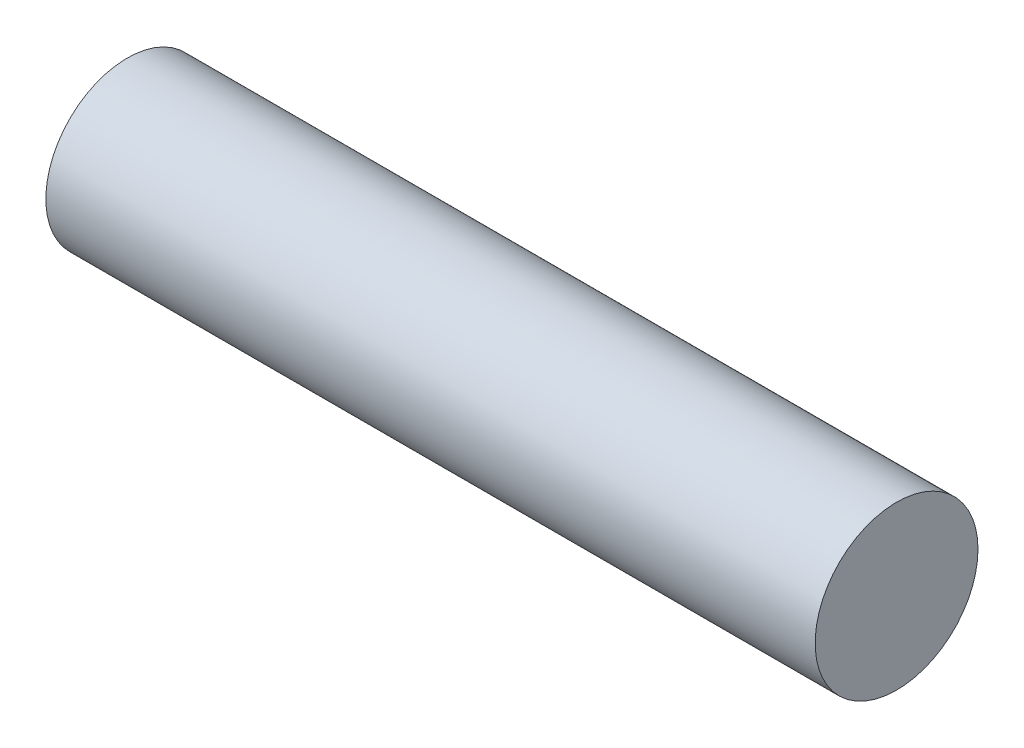
ISO-10303-21;
HEADER;
FILE_DESCRIPTION(('STEP AP214'),'2;1');
FILE_NAME('part.step','',(''),(''),'','','');
FILE_SCHEMA(('AUTOMOTIVE_DESIGN { 1 0 10303 214 1 1 1 1 }'));
ENDSEC;
DATA;
#1=APPLICATION_CONTEXT('core data for automotive mechanical design processes');
#2=APPLICATION_PROTOCOL_DEFINITION('international standard','automotive_design',2000,#1);
#3=PRODUCT_CONTEXT('',#1,'mechanical');
#4=PRODUCT('Part','Part','',(#3));
#5=PRODUCT_RELATED_PRODUCT_CATEGORY('part','',(#4));
#6=PRODUCT_DEFINITION_FORMATION('','',#4);
#7=PRODUCT_DEFINITION_CONTEXT('part definition',#1,'design');
#8=PRODUCT_DEFINITION('design','',#6,#7);
#9=PRODUCT_DEFINITION_SHAPE('','',#8);
#10=(LENGTH_UNIT() NAMED_UNIT(*) SI_UNIT(.MILLI.,.METRE.));
#11=(NAMED_UNIT(*) PLANE_ANGLE_UNIT() SI_UNIT($,.RADIAN.));
#12=(NAMED_UNIT(*) SI_UNIT($,.STERADIAN.) SOLID_ANGLE_UNIT());
#13=UNCERTAINTY_MEASURE_WITH_UNIT(LENGTH_MEASURE(1.E-05),#10,'distance_accuracy_value','');
#14=(GEOMETRIC_REPRESENTATION_CONTEXT(3) GLOBAL_UNCERTAINTY_ASSIGNED_CONTEXT((#13)) GLOBAL_UNIT_ASSIGNED_CONTEXT((#10,
#11,#12)) REPRESENTATION_CONTEXT('',''));
#15=CARTESIAN_POINT('',(0.,0.,0.));
#16=DIRECTION('',(0.,0.,1.));
#17=DIRECTION('',(1.,0.,0.));
#18=AXIS2_PLACEMENT_3D('',#15,#16,#17);
#19=CARTESIAN_POINT('',(-30.9019900770766,0.,0.));
#20=DIRECTION('',(1.,0.,0.));
#21=DIRECTION('',(0.,0.,-1.));
#22=AXIS2_PLACEMENT_3D('',#19,#20,#21);
#23=PLANE('',#22);
#24=CARTESIAN_POINT('',(-30.9019900770766,0.,0.));
#25=DIRECTION('',(1.,0.,0.));
#26=DIRECTION('',(0.,0.,-1.));
#27=AXIS2_PLACEMENT_3D('',#24,#25,#26);
#28=CIRCLE('',#27,3.175);
#29=CARTESIAN_POINT('',(-30.9019900770766,0.,-3.175));
#30=VERTEX_POINT('',#29);
#31=EDGE_CURVE('E54',#30,#30,#28,.T.);
#32=ORIENTED_EDGE('',*,*,#31,.F.);
#33=EDGE_LOOP('',(#32));
#34=FACE_BOUND('',#33,.T.);
#35=ADVANCED_FACE('F47',(#34),#23,.F.);
#36=CARTESIAN_POINT('',(-0.901990077076587,0.,0.));
#37=DIRECTION('',(1.,0.,0.));
#38=DIRECTION('',(0.,0.,-1.));
#39=AXIS2_PLACEMENT_3D('',#36,#37,#38);
#40=PLANE('',#39);
#41=CARTESIAN_POINT('',(-0.901990077076587,0.,0.));
#42=DIRECTION('',(1.,0.,0.));
#43=DIRECTION('',(0.,0.,-1.));
#44=AXIS2_PLACEMENT_3D('',#41,#42,#43);
#45=CIRCLE('',#44,3.175);
#46=CARTESIAN_POINT('',(-0.901990077076587,0.,-3.175));
#47=VERTEX_POINT('',#46);
#48=EDGE_CURVE('E11',#47,#47,#45,.T.);
#49=ORIENTED_EDGE('',*,*,#48,.T.);
#50=EDGE_LOOP('',(#49));
#51=FACE_BOUND('',#50,.T.);
#52=ADVANCED_FACE('F64',(#51),#40,.T.);
#53=CARTESIAN_POINT('',(-30.9019900770766,0.,0.));
#54=DIRECTION('',(1.,0.,0.));
#55=DIRECTION('',(0.,0.,-1.));
#56=AXIS2_PLACEMENT_3D('',#53,#54,#55);
#57=CYLINDRICAL_SURFACE('',#56,3.175);
#58=ORIENTED_EDGE('',*,*,#48,.F.);
#59=EDGE_LOOP('',(#58));
#60=FACE_BOUND('',#59,.T.);
#61=ORIENTED_EDGE('',*,*,#31,.T.);
#62=EDGE_LOOP('',(#61));
#63=FACE_BOUND('',#62,.T.);
#64=ADVANCED_FACE('F61',(#60,#63),#57,.T.);
#65=CLOSED_SHELL('',(#35,#52,#64));
#66=MANIFOLD_SOLID_BREP('B2',#65);
#67=ADVANCED_BREP_SHAPE_REPRESENTATION('',(#18,#66),#14);
#68=SHAPE_DEFINITION_REPRESENTATION(#9,#67);
ENDSEC;
END-ISO-10303-21;
